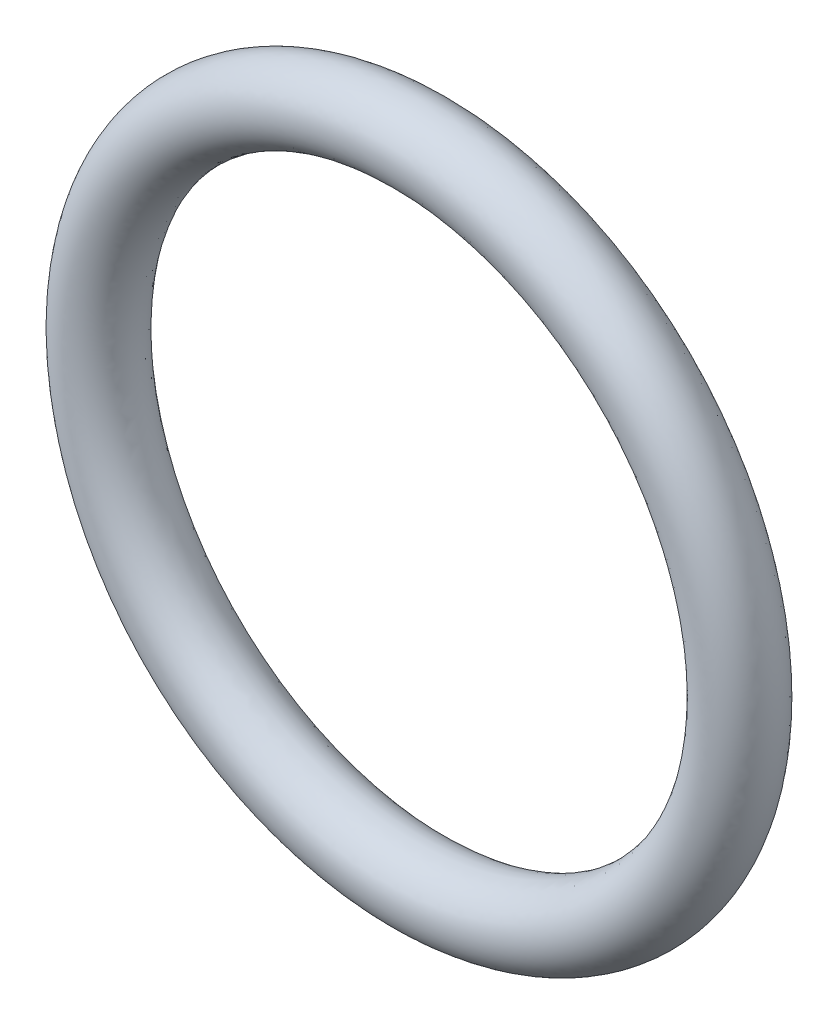
ISO-10303-21;
HEADER;
FILE_DESCRIPTION(('STEP AP214'),'2;1');
FILE_NAME('part.step','',(''),(''),'','','');
FILE_SCHEMA(('AUTOMOTIVE_DESIGN { 1 0 10303 214 1 1 1 1 }'));
ENDSEC;
DATA;
#1=APPLICATION_CONTEXT('core data for automotive mechanical design processes');
#2=APPLICATION_PROTOCOL_DEFINITION('international standard','automotive_design',2000,#1);
#3=PRODUCT_CONTEXT('',#1,'mechanical');
#4=PRODUCT('Part','Part','',(#3));
#5=PRODUCT_RELATED_PRODUCT_CATEGORY('part','',(#4));
#6=PRODUCT_DEFINITION_FORMATION('','',#4);
#7=PRODUCT_DEFINITION_CONTEXT('part definition',#1,'design');
#8=PRODUCT_DEFINITION('design','',#6,#7);
#9=PRODUCT_DEFINITION_SHAPE('','',#8);
#10=(LENGTH_UNIT() NAMED_UNIT(*) SI_UNIT(.MILLI.,.METRE.));
#11=(NAMED_UNIT(*) PLANE_ANGLE_UNIT() SI_UNIT($,.RADIAN.));
#12=(NAMED_UNIT(*) SI_UNIT($,.STERADIAN.) SOLID_ANGLE_UNIT());
#13=UNCERTAINTY_MEASURE_WITH_UNIT(LENGTH_MEASURE(1.E-05),#10,'distance_accuracy_value','');
#14=(GEOMETRIC_REPRESENTATION_CONTEXT(3) GLOBAL_UNCERTAINTY_ASSIGNED_CONTEXT((#13)) GLOBAL_UNIT_ASSIGNED_CONTEXT((#10,
#11,#12)) REPRESENTATION_CONTEXT('',''));
#15=CARTESIAN_POINT('',(0.,0.,0.));
#16=DIRECTION('',(0.,0.,1.));
#17=DIRECTION('',(1.,0.,0.));
#18=AXIS2_PLACEMENT_3D('',#15,#16,#17);
#19=CARTESIAN_POINT('',(0.,22.98,-2.66));
#20=DIRECTION('',(1.,0.,0.));
#21=DIRECTION('',(0.,0.,-1.));
#22=AXIS2_PLACEMENT_3D('',#19,#20,#21);
#23=ELLIPSE('',#22,2.66,2.66);
#24=CARTESIAN_POINT('',(0.,0.,0.));
#25=DIRECTION('',(0.,0.,1.));
#26=AXIS1_PLACEMENT('',#24,#25);
#27=SURFACE_OF_REVOLUTION('',#23,#26);
#28=ADVANCED_FACE('F29',(),#27,.T.);
#29=CLOSED_SHELL('',(#28));
#30=MANIFOLD_SOLID_BREP('B2',#29);
#31=ADVANCED_BREP_SHAPE_REPRESENTATION('',(#18,#30),#14);
#32=SHAPE_DEFINITION_REPRESENTATION(#9,#31);
ENDSEC;
END-ISO-10303-21;
